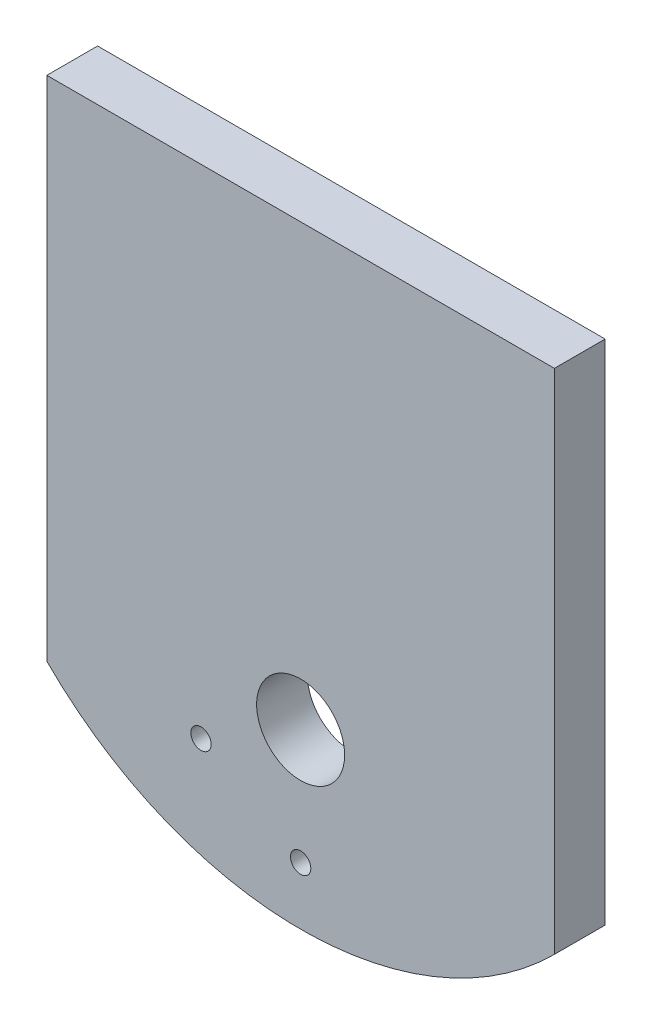
ISO-10303-21;
HEADER;
FILE_DESCRIPTION(('STEP AP214'),'2;1');
FILE_NAME('part.step','',(''),(''),'','','');
FILE_SCHEMA(('AUTOMOTIVE_DESIGN { 1 0 10303 214 1 1 1 1 }'));
ENDSEC;
DATA;
#1=APPLICATION_CONTEXT('core data for automotive mechanical design processes');
#2=APPLICATION_PROTOCOL_DEFINITION('international standard','automotive_design',2000,#1);
#3=PRODUCT_CONTEXT('',#1,'mechanical');
#4=PRODUCT('Part','Part','',(#3));
#5=PRODUCT_RELATED_PRODUCT_CATEGORY('part','',(#4));
#6=PRODUCT_DEFINITION_FORMATION('','',#4);
#7=PRODUCT_DEFINITION_CONTEXT('part definition',#1,'design');
#8=PRODUCT_DEFINITION('design','',#6,#7);
#9=PRODUCT_DEFINITION_SHAPE('','',#8);
#10=(LENGTH_UNIT() NAMED_UNIT(*) SI_UNIT(.MILLI.,.METRE.));
#11=(NAMED_UNIT(*) PLANE_ANGLE_UNIT() SI_UNIT($,.RADIAN.));
#12=(NAMED_UNIT(*) SI_UNIT($,.STERADIAN.) SOLID_ANGLE_UNIT());
#13=UNCERTAINTY_MEASURE_WITH_UNIT(LENGTH_MEASURE(1.E-05),#10,'distance_accuracy_value','');
#14=(GEOMETRIC_REPRESENTATION_CONTEXT(3) GLOBAL_UNCERTAINTY_ASSIGNED_CONTEXT((#13)) GLOBAL_UNIT_ASSIGNED_CONTEXT((#10,
#11,#12)) REPRESENTATION_CONTEXT('',''));
#15=CARTESIAN_POINT('',(0.,0.,0.));
#16=DIRECTION('',(0.,0.,1.));
#17=DIRECTION('',(1.,0.,0.));
#18=AXIS2_PLACEMENT_3D('',#15,#16,#17);
#19=CARTESIAN_POINT('',(-75.,0.,15.));
#20=DIRECTION('',(-1.,0.,0.));
#21=DIRECTION('',(0.,0.,1.));
#22=AXIS2_PLACEMENT_3D('',#19,#20,#21);
#23=PLANE('',#22);
#24=DIRECTION('',(0.,1.,0.));
#25=VECTOR('',#24,1.);
#26=CARTESIAN_POINT('',(-75.,0.,0.));
#27=LINE('',#26,#25);
#28=CARTESIAN_POINT('',(-75.,-105.,0.));
#29=VERTEX_POINT('',#28);
#30=CARTESIAN_POINT('',(-75.,45.,0.));
#31=VERTEX_POINT('',#30);
#32=EDGE_CURVE('E119',#29,#31,#27,.T.);
#33=ORIENTED_EDGE('',*,*,#32,.F.);
#34=DIRECTION('',(0.,0.,-1.));
#35=VECTOR('',#34,1.);
#36=CARTESIAN_POINT('',(-75.,-105.,15.));
#37=LINE('',#36,#35);
#38=CARTESIAN_POINT('',(-75.,-105.,15.));
#39=VERTEX_POINT('',#38);
#40=EDGE_CURVE('E11',#39,#29,#37,.T.);
#41=ORIENTED_EDGE('',*,*,#40,.F.);
#42=DIRECTION('',(0.,1.,0.));
#43=VECTOR('',#42,1.);
#44=CARTESIAN_POINT('',(-75.,0.,15.));
#45=LINE('',#44,#43);
#46=CARTESIAN_POINT('',(-75.,45.,15.));
#47=VERTEX_POINT('',#46);
#48=EDGE_CURVE('E122',#39,#47,#45,.T.);
#49=ORIENTED_EDGE('',*,*,#48,.T.);
#50=DIRECTION('',(0.,0.,-1.));
#51=VECTOR('',#50,1.);
#52=CARTESIAN_POINT('',(-75.,45.,15.));
#53=LINE('',#52,#51);
#54=EDGE_CURVE('E51',#47,#31,#53,.T.);
#55=ORIENTED_EDGE('',*,*,#54,.T.);
#56=EDGE_LOOP('',(#33,#41,#49,#55));
#57=FACE_BOUND('',#56,.T.);
#58=ADVANCED_FACE('F35',(#57),#23,.T.);
#59=CARTESIAN_POINT('',(0.,-30.,15.));
#60=DIRECTION('',(0.,0.,-1.));
#61=DIRECTION('',(-1.,0.,0.));
#62=AXIS2_PLACEMENT_3D('',#59,#60,#61);
#63=CYLINDRICAL_SURFACE('',#62,106.066017177982);
#64=CARTESIAN_POINT('',(0.,-30.,0.));
#65=DIRECTION('',(0.,0.,1.));
#66=DIRECTION('',(1.,0.,0.));
#67=AXIS2_PLACEMENT_3D('',#64,#65,#66);
#68=CIRCLE('',#67,106.066017177982);
#69=CARTESIAN_POINT('',(75.,-105.,0.));
#70=VERTEX_POINT('',#69);
#71=EDGE_CURVE('E132',#29,#70,#68,.T.);
#72=ORIENTED_EDGE('',*,*,#71,.T.);
#73=DIRECTION('',(0.,0.,-1.));
#74=VECTOR('',#73,1.);
#75=CARTESIAN_POINT('',(75.,-105.,15.));
#76=LINE('',#75,#74);
#77=CARTESIAN_POINT('',(75.,-105.,15.));
#78=VERTEX_POINT('',#77);
#79=EDGE_CURVE('E43',#78,#70,#76,.T.);
#80=ORIENTED_EDGE('',*,*,#79,.F.);
#81=CARTESIAN_POINT('',(0.,-30.,15.));
#82=DIRECTION('',(0.,0.,1.));
#83=DIRECTION('',(1.,0.,0.));
#84=AXIS2_PLACEMENT_3D('',#81,#82,#83);
#85=CIRCLE('',#84,106.066017177982);
#86=EDGE_CURVE('E124',#39,#78,#85,.T.);
#87=ORIENTED_EDGE('',*,*,#86,.F.);
#88=ORIENTED_EDGE('',*,*,#40,.T.);
#89=EDGE_LOOP('',(#72,#80,#87,#88));
#90=FACE_BOUND('',#89,.T.);
#91=ADVANCED_FACE('F159',(#90),#63,.T.);
#92=CARTESIAN_POINT('',(75.,0.,15.));
#93=DIRECTION('',(-1.,0.,0.));
#94=DIRECTION('',(0.,0.,1.));
#95=AXIS2_PLACEMENT_3D('',#92,#93,#94);
#96=PLANE('',#95);
#97=DIRECTION('',(0.,1.,0.));
#98=VECTOR('',#97,1.);
#99=CARTESIAN_POINT('',(75.,0.,0.));
#100=LINE('',#99,#98);
#101=CARTESIAN_POINT('',(75.,45.,0.));
#102=VERTEX_POINT('',#101);
#103=EDGE_CURVE('E134',#70,#102,#100,.T.);
#104=ORIENTED_EDGE('',*,*,#103,.T.);
#105=DIRECTION('',(0.,0.,-1.));
#106=VECTOR('',#105,1.);
#107=CARTESIAN_POINT('',(75.,45.,15.));
#108=LINE('',#107,#106);
#109=CARTESIAN_POINT('',(75.,45.,15.));
#110=VERTEX_POINT('',#109);
#111=EDGE_CURVE('E66',#110,#102,#108,.T.);
#112=ORIENTED_EDGE('',*,*,#111,.F.);
#113=DIRECTION('',(0.,1.,0.));
#114=VECTOR('',#113,1.);
#115=CARTESIAN_POINT('',(75.,0.,15.));
#116=LINE('',#115,#114);
#117=EDGE_CURVE('E127',#78,#110,#116,.T.);
#118=ORIENTED_EDGE('',*,*,#117,.F.);
#119=ORIENTED_EDGE('',*,*,#79,.T.);
#120=EDGE_LOOP('',(#104,#112,#118,#119));
#121=FACE_BOUND('',#120,.T.);
#122=ADVANCED_FACE('F144',(#121),#96,.F.);
#123=CARTESIAN_POINT('',(0.,45.,15.));
#124=DIRECTION('',(0.,1.,0.));
#125=DIRECTION('',(0.,0.,1.));
#126=AXIS2_PLACEMENT_3D('',#123,#124,#125);
#127=PLANE('',#126);
#128=DIRECTION('',(1.,0.,0.));
#129=VECTOR('',#128,1.);
#130=CARTESIAN_POINT('',(0.,45.,0.));
#131=LINE('',#130,#129);
#132=EDGE_CURVE('E125',#31,#102,#131,.T.);
#133=ORIENTED_EDGE('',*,*,#132,.F.);
#134=ORIENTED_EDGE('',*,*,#54,.F.);
#135=DIRECTION('',(1.,0.,0.));
#136=VECTOR('',#135,1.);
#137=CARTESIAN_POINT('',(0.,45.,15.));
#138=LINE('',#137,#136);
#139=EDGE_CURVE('E129',#47,#110,#138,.T.);
#140=ORIENTED_EDGE('',*,*,#139,.T.);
#141=ORIENTED_EDGE('',*,*,#111,.T.);
#142=EDGE_LOOP('',(#133,#134,#140,#141));
#143=FACE_BOUND('',#142,.T.);
#144=ADVANCED_FACE('F149',(#143),#127,.T.);
#145=CARTESIAN_POINT('',(0.,0.,15.));
#146=DIRECTION('',(0.,0.,1.));
#147=DIRECTION('',(1.,0.,0.));
#148=AXIS2_PLACEMENT_3D('',#145,#146,#147);
#149=PLANE('',#148);
#150=CARTESIAN_POINT('',(-29.4448637286708,-102.,15.));
#151=DIRECTION('',(0.,0.,1.));
#152=DIRECTION('',(1.,0.,0.));
#153=AXIS2_PLACEMENT_3D('',#150,#151,#152);
#154=CIRCLE('',#153,3.00999999999999);
#155=CARTESIAN_POINT('',(-26.4348637286708,-102.,15.));
#156=VERTEX_POINT('',#155);
#157=EDGE_CURVE('E103',#156,#156,#154,.T.);
#158=ORIENTED_EDGE('',*,*,#157,.F.);
#159=EDGE_LOOP('',(#158));
#160=FACE_BOUND('',#159,.T.);
#161=CARTESIAN_POINT('',(0.,-119.,15.));
#162=DIRECTION('',(0.,0.,1.));
#163=DIRECTION('',(1.,0.,0.));
#164=AXIS2_PLACEMENT_3D('',#161,#162,#163);
#165=CIRCLE('',#164,3.01);
#166=CARTESIAN_POINT('',(3.01000000000002,-119.,15.));
#167=VERTEX_POINT('',#166);
#168=EDGE_CURVE('E107',#167,#167,#165,.T.);
#169=ORIENTED_EDGE('',*,*,#168,.F.);
#170=EDGE_LOOP('',(#169));
#171=FACE_BOUND('',#170,.T.);
#172=CARTESIAN_POINT('',(0.,-85.,15.));
#173=DIRECTION('',(0.,0.,1.));
#174=DIRECTION('',(1.,0.,0.));
#175=AXIS2_PLACEMENT_3D('',#172,#173,#174);
#176=CIRCLE('',#175,13.005);
#177=CARTESIAN_POINT('',(13.005,-85.,15.));
#178=VERTEX_POINT('',#177);
#179=EDGE_CURVE('E113',#178,#178,#176,.T.);
#180=ORIENTED_EDGE('',*,*,#179,.F.);
#181=EDGE_LOOP('',(#180));
#182=FACE_BOUND('',#181,.T.);
#183=ORIENTED_EDGE('',*,*,#48,.F.);
#184=ORIENTED_EDGE('',*,*,#86,.T.);
#185=ORIENTED_EDGE('',*,*,#117,.T.);
#186=ORIENTED_EDGE('',*,*,#139,.F.);
#187=EDGE_LOOP('',(#183,#184,#185,#186));
#188=FACE_BOUND('',#187,.T.);
#189=ADVANCED_FACE('F151',(#160,#171,#182,#188),#149,.T.);
#190=CARTESIAN_POINT('',(0.,0.,0.));
#191=DIRECTION('',(0.,0.,1.));
#192=DIRECTION('',(1.,0.,0.));
#193=AXIS2_PLACEMENT_3D('',#190,#191,#192);
#194=PLANE('',#193);
#195=CARTESIAN_POINT('',(37.5,-50.,0.));
#196=DIRECTION('',(0.,0.,-1.));
#197=DIRECTION('',(-1.,0.,0.));
#198=AXIS2_PLACEMENT_3D('',#195,#196,#197);
#199=CIRCLE('',#198,3.4);
#200=CARTESIAN_POINT('',(34.1,-50.,0.));
#201=VERTEX_POINT('',#200);
#202=EDGE_CURVE('E93',#201,#201,#199,.T.);
#203=ORIENTED_EDGE('',*,*,#202,.F.);
#204=EDGE_LOOP('',(#203));
#205=FACE_BOUND('',#204,.T.);
#206=CARTESIAN_POINT('',(-37.5,-50.,0.));
#207=DIRECTION('',(0.,0.,-1.));
#208=DIRECTION('',(-1.,0.,0.));
#209=AXIS2_PLACEMENT_3D('',#206,#207,#208);
#210=CIRCLE('',#209,3.4);
#211=CARTESIAN_POINT('',(-40.9,-50.,0.));
#212=VERTEX_POINT('',#211);
#213=EDGE_CURVE('E92',#212,#212,#210,.T.);
#214=ORIENTED_EDGE('',*,*,#213,.F.);
#215=EDGE_LOOP('',(#214));
#216=FACE_BOUND('',#215,.T.);
#217=CARTESIAN_POINT('',(-29.4448637286708,-102.,0.));
#218=DIRECTION('',(0.,0.,1.));
#219=DIRECTION('',(1.,0.,0.));
#220=AXIS2_PLACEMENT_3D('',#217,#218,#219);
#221=CIRCLE('',#220,3.00999999999999);
#222=CARTESIAN_POINT('',(-26.4348637286708,-102.,0.));
#223=VERTEX_POINT('',#222);
#224=EDGE_CURVE('E104',#223,#223,#221,.T.);
#225=ORIENTED_EDGE('',*,*,#224,.T.);
#226=EDGE_LOOP('',(#225));
#227=FACE_BOUND('',#226,.T.);
#228=CARTESIAN_POINT('',(0.,-119.,0.));
#229=DIRECTION('',(0.,0.,1.));
#230=DIRECTION('',(1.,0.,0.));
#231=AXIS2_PLACEMENT_3D('',#228,#229,#230);
#232=CIRCLE('',#231,3.01);
#233=CARTESIAN_POINT('',(3.01000000000002,-119.,0.));
#234=VERTEX_POINT('',#233);
#235=EDGE_CURVE('E110',#234,#234,#232,.T.);
#236=ORIENTED_EDGE('',*,*,#235,.T.);
#237=EDGE_LOOP('',(#236));
#238=FACE_BOUND('',#237,.T.);
#239=CARTESIAN_POINT('',(0.,-85.,0.));
#240=DIRECTION('',(0.,0.,1.));
#241=DIRECTION('',(1.,0.,0.));
#242=AXIS2_PLACEMENT_3D('',#239,#240,#241);
#243=CIRCLE('',#242,13.005);
#244=CARTESIAN_POINT('',(13.005,-85.,0.));
#245=VERTEX_POINT('',#244);
#246=EDGE_CURVE('E116',#245,#245,#243,.T.);
#247=ORIENTED_EDGE('',*,*,#246,.T.);
#248=EDGE_LOOP('',(#247));
#249=FACE_BOUND('',#248,.T.);
#250=ORIENTED_EDGE('',*,*,#32,.T.);
#251=ORIENTED_EDGE('',*,*,#132,.T.);
#252=ORIENTED_EDGE('',*,*,#103,.F.);
#253=ORIENTED_EDGE('',*,*,#71,.F.);
#254=EDGE_LOOP('',(#250,#251,#252,#253));
#255=FACE_BOUND('',#254,.T.);
#256=ADVANCED_FACE('F148',(#205,#216,#227,#238,#249,#255),#194,.F.);
#257=CARTESIAN_POINT('',(0.,-85.,0.));
#258=DIRECTION('',(0.,0.,1.));
#259=DIRECTION('',(1.,0.,0.));
#260=AXIS2_PLACEMENT_3D('',#257,#258,#259);
#261=CYLINDRICAL_SURFACE('',#260,13.005);
#262=ORIENTED_EDGE('',*,*,#246,.F.);
#263=EDGE_LOOP('',(#262));
#264=FACE_BOUND('',#263,.T.);
#265=ORIENTED_EDGE('',*,*,#179,.T.);
#266=EDGE_LOOP('',(#265));
#267=FACE_BOUND('',#266,.T.);
#268=ADVANCED_FACE('F195',(#264,#267),#261,.F.);
#269=CARTESIAN_POINT('',(0.,-119.,0.));
#270=DIRECTION('',(0.,0.,1.));
#271=DIRECTION('',(1.,0.,0.));
#272=AXIS2_PLACEMENT_3D('',#269,#270,#271);
#273=CYLINDRICAL_SURFACE('',#272,3.01);
#274=ORIENTED_EDGE('',*,*,#235,.F.);
#275=EDGE_LOOP('',(#274));
#276=FACE_BOUND('',#275,.T.);
#277=ORIENTED_EDGE('',*,*,#168,.T.);
#278=EDGE_LOOP('',(#277));
#279=FACE_BOUND('',#278,.T.);
#280=ADVANCED_FACE('F200',(#276,#279),#273,.F.);
#281=CARTESIAN_POINT('',(-29.4448637286708,-102.,0.));
#282=DIRECTION('',(0.,0.,1.));
#283=DIRECTION('',(1.,0.,0.));
#284=AXIS2_PLACEMENT_3D('',#281,#282,#283);
#285=CYLINDRICAL_SURFACE('',#284,3.00999999999999);
#286=ORIENTED_EDGE('',*,*,#224,.F.);
#287=EDGE_LOOP('',(#286));
#288=FACE_BOUND('',#287,.T.);
#289=ORIENTED_EDGE('',*,*,#157,.T.);
#290=EDGE_LOOP('',(#289));
#291=FACE_BOUND('',#290,.T.);
#292=ADVANCED_FACE('F211',(#288,#291),#285,.F.);
#293=CARTESIAN_POINT('',(-37.5,-50.,10.));
#294=DIRECTION('',(0.,0.,-1.));
#295=DIRECTION('',(-1.,0.,0.));
#296=AXIS2_PLACEMENT_3D('',#293,#294,#295);
#297=CONICAL_SURFACE('',#296,3.39999999999999,1.02974425867665);
#298=CARTESIAN_POINT('',(-37.5,-50.,12.0429261046937));
#299=VERTEX_POINT('',#298);
#300=VERTEX_LOOP('',#299);
#301=FACE_BOUND('',#300,.T.);
#302=CARTESIAN_POINT('',(-37.5,-50.,10.));
#303=DIRECTION('',(0.,0.,-1.));
#304=DIRECTION('',(-1.,0.,0.));
#305=AXIS2_PLACEMENT_3D('',#302,#303,#304);
#306=CIRCLE('',#305,3.39999999999999);
#307=CARTESIAN_POINT('',(-40.9,-50.,10.));
#308=VERTEX_POINT('',#307);
#309=EDGE_CURVE('E96',#308,#308,#306,.T.);
#310=ORIENTED_EDGE('',*,*,#309,.T.);
#311=EDGE_LOOP('',(#310));
#312=FACE_BOUND('',#311,.T.);
#313=ADVANCED_FACE('F221',(#301,#312),#297,.F.);
#314=CARTESIAN_POINT('',(-37.5,-50.,0.));
#315=DIRECTION('',(0.,0.,-1.));
#316=DIRECTION('',(-1.,0.,0.));
#317=AXIS2_PLACEMENT_3D('',#314,#315,#316);
#318=CYLINDRICAL_SURFACE('',#317,3.4);
#319=ORIENTED_EDGE('',*,*,#309,.F.);
#320=EDGE_LOOP('',(#319));
#321=FACE_BOUND('',#320,.T.);
#322=ORIENTED_EDGE('',*,*,#213,.T.);
#323=EDGE_LOOP('',(#322));
#324=FACE_BOUND('',#323,.T.);
#325=ADVANCED_FACE('F86',(#321,#324),#318,.F.);
#326=CARTESIAN_POINT('',(37.5,-50.,10.));
#327=DIRECTION('',(0.,0.,-1.));
#328=DIRECTION('',(-1.,0.,0.));
#329=AXIS2_PLACEMENT_3D('',#326,#327,#328);
#330=CONICAL_SURFACE('',#329,3.39999999999999,1.02974425867665);
#331=CARTESIAN_POINT('',(37.5,-50.,12.0429261046937));
#332=VERTEX_POINT('',#331);
#333=VERTEX_LOOP('',#332);
#334=FACE_BOUND('',#333,.T.);
#335=CARTESIAN_POINT('',(37.5,-50.,10.));
#336=DIRECTION('',(0.,0.,-1.));
#337=DIRECTION('',(-1.,0.,0.));
#338=AXIS2_PLACEMENT_3D('',#335,#336,#337);
#339=CIRCLE('',#338,3.39999999999999);
#340=CARTESIAN_POINT('',(34.1,-50.,10.));
#341=VERTEX_POINT('',#340);
#342=EDGE_CURVE('E90',#341,#341,#339,.T.);
#343=ORIENTED_EDGE('',*,*,#342,.T.);
#344=EDGE_LOOP('',(#343));
#345=FACE_BOUND('',#344,.T.);
#346=ADVANCED_FACE('F82',(#334,#345),#330,.F.);
#347=CARTESIAN_POINT('',(37.5,-50.,0.));
#348=DIRECTION('',(0.,0.,-1.));
#349=DIRECTION('',(-1.,0.,0.));
#350=AXIS2_PLACEMENT_3D('',#347,#348,#349);
#351=CYLINDRICAL_SURFACE('',#350,3.4);
#352=ORIENTED_EDGE('',*,*,#342,.F.);
#353=EDGE_LOOP('',(#352));
#354=FACE_BOUND('',#353,.T.);
#355=ORIENTED_EDGE('',*,*,#202,.T.);
#356=EDGE_LOOP('',(#355));
#357=FACE_BOUND('',#356,.T.);
#358=ADVANCED_FACE('F85',(#354,#357),#351,.F.);
#359=CLOSED_SHELL('',(#58,#91,#122,#144,#189,#256,#268,#280,#292,#313,#325,#346,#358));
#360=MANIFOLD_SOLID_BREP('B2',#359);
#361=ADVANCED_BREP_SHAPE_REPRESENTATION('',(#18,#360),#14);
#362=SHAPE_DEFINITION_REPRESENTATION(#9,#361);
ENDSEC;
END-ISO-10303-21;
